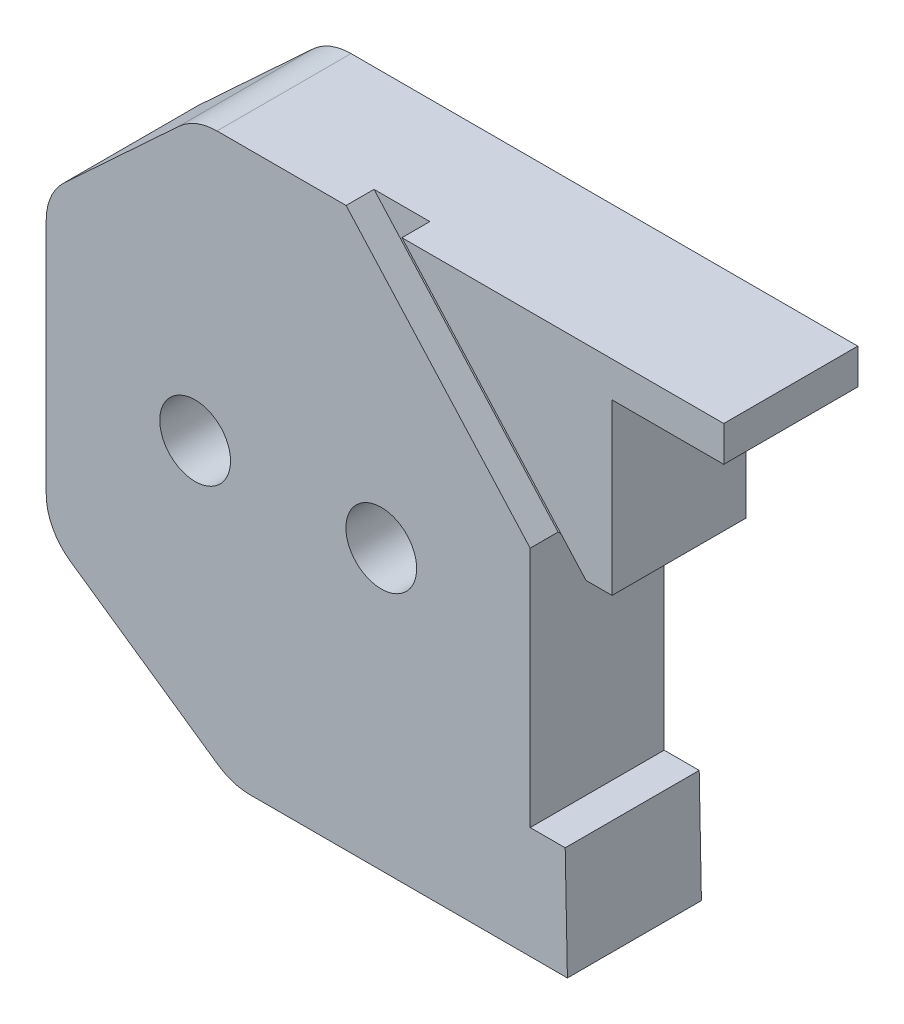
ISO-10303-21;
HEADER;
FILE_DESCRIPTION(('STEP AP214'),'2;1');
FILE_NAME('part.step','',(''),(''),'','','');
FILE_SCHEMA(('AUTOMOTIVE_DESIGN { 1 0 10303 214 1 1 1 1 }'));
ENDSEC;
DATA;
#1=APPLICATION_CONTEXT('core data for automotive mechanical design processes');
#2=APPLICATION_PROTOCOL_DEFINITION('international standard','automotive_design',2000,#1);
#3=PRODUCT_CONTEXT('',#1,'mechanical');
#4=PRODUCT('Part','Part','',(#3));
#5=PRODUCT_RELATED_PRODUCT_CATEGORY('part','',(#4));
#6=PRODUCT_DEFINITION_FORMATION('','',#4);
#7=PRODUCT_DEFINITION_CONTEXT('part definition',#1,'design');
#8=PRODUCT_DEFINITION('design','',#6,#7);
#9=PRODUCT_DEFINITION_SHAPE('','',#8);
#10=(LENGTH_UNIT() NAMED_UNIT(*) SI_UNIT(.MILLI.,.METRE.));
#11=(NAMED_UNIT(*) PLANE_ANGLE_UNIT() SI_UNIT($,.RADIAN.));
#12=(NAMED_UNIT(*) SI_UNIT($,.STERADIAN.) SOLID_ANGLE_UNIT());
#13=UNCERTAINTY_MEASURE_WITH_UNIT(LENGTH_MEASURE(1.E-05),#10,'distance_accuracy_value','');
#14=(GEOMETRIC_REPRESENTATION_CONTEXT(3) GLOBAL_UNCERTAINTY_ASSIGNED_CONTEXT((#13)) GLOBAL_UNIT_ASSIGNED_CONTEXT((#10,
#11,#12)) REPRESENTATION_CONTEXT('',''));
#15=CARTESIAN_POINT('',(0.,0.,0.));
#16=DIRECTION('',(0.,0.,1.));
#17=DIRECTION('',(1.,0.,0.));
#18=AXIS2_PLACEMENT_3D('',#15,#16,#17);
#19=CARTESIAN_POINT('',(0.,0.,6.4));
#20=DIRECTION('',(0.,0.,1.));
#21=DIRECTION('',(1.,0.,0.));
#22=AXIS2_PLACEMENT_3D('',#19,#20,#21);
#23=PLANE('',#22);
#24=CARTESIAN_POINT('',(-11.7,0.,6.4));
#25=DIRECTION('',(0.,0.,1.));
#26=DIRECTION('',(1.,0.,0.));
#27=AXIS2_PLACEMENT_3D('',#24,#25,#26);
#28=CIRCLE('',#27,0.950000000000001);
#29=CARTESIAN_POINT('',(-10.75,0.,6.4));
#30=VERTEX_POINT('',#29);
#31=EDGE_CURVE('E404',#30,#30,#28,.F.);
#32=ORIENTED_EDGE('',*,*,#31,.F.);
#33=EDGE_LOOP('',(#32));
#34=FACE_BOUND('',#33,.T.);
#35=DIRECTION('',(-1.,0.,0.));
#36=VECTOR('',#35,1.);
#37=CARTESIAN_POINT('',(-6.75907917408683,-4.5,6.4));
#38=LINE('',#37,#36);
#39=CARTESIAN_POINT('',(-6.75907917408683,-4.5,6.4));
#40=VERTEX_POINT('',#39);
#41=CARTESIAN_POINT('',(-7.7,-4.5,6.4));
#42=VERTEX_POINT('',#41);
#43=EDGE_CURVE('E435',#40,#42,#38,.T.);
#44=ORIENTED_EDGE('',*,*,#43,.F.);
#45=DIRECTION('',(-0.0196892404925269,0.999806148115137,0.));
#46=VECTOR('',#45,1.);
#47=CARTESIAN_POINT('',(-6.69999999999999,-7.5,6.4));
#48=LINE('',#47,#46);
#49=CARTESIAN_POINT('',(-6.69999999999999,-7.5,6.4));
#50=VERTEX_POINT('',#49);
#51=EDGE_CURVE('E400',#50,#40,#48,.T.);
#52=ORIENTED_EDGE('',*,*,#51,.F.);
#53=DIRECTION('',(1.,0.,0.));
#54=VECTOR('',#53,1.);
#55=CARTESIAN_POINT('',(-15.7,-7.5,6.4));
#56=LINE('',#55,#54);
#57=CARTESIAN_POINT('',(-15.23067743474,-7.5,6.4));
#58=VERTEX_POINT('',#57);
#59=EDGE_CURVE('E423',#58,#50,#56,.T.);
#60=ORIENTED_EDGE('',*,*,#59,.F.);
#61=CARTESIAN_POINT('',(-15.23067743474,-6.,6.4));
#62=DIRECTION('',(0.,0.,1.));
#63=DIRECTION('',(1.,0.,0.));
#64=AXIS2_PLACEMENT_3D('',#61,#62,#63);
#65=CIRCLE('',#64,1.5);
#66=CARTESIAN_POINT('',(-16.0856272804161,-7.23250183017247,6.4));
#67=VERTEX_POINT('',#66);
#68=EDGE_CURVE('E418',#58,#67,#65,.F.);
#69=ORIENTED_EDGE('',*,*,#68,.T.);
#70=DIRECTION('',(0.821667886781642,-0.569966563784045,0.));
#71=VECTOR('',#70,1.);
#72=CARTESIAN_POINT('',(-20.7,-4.03164877833717,6.4));
#73=LINE('',#72,#71);
#74=CARTESIAN_POINT('',(-20.0549498456761,-4.47910087649381,6.4));
#75=VERTEX_POINT('',#74);
#76=EDGE_CURVE('E426',#75,#67,#73,.T.);
#77=ORIENTED_EDGE('',*,*,#76,.F.);
#78=CARTESIAN_POINT('',(-19.2,-3.24659904632135,6.4));
#79=DIRECTION('',(0.,0.,1.));
#80=DIRECTION('',(1.,0.,0.));
#81=AXIS2_PLACEMENT_3D('',#78,#79,#80);
#82=CIRCLE('',#81,1.5);
#83=CARTESIAN_POINT('',(-20.7,-3.24659904632135,6.4));
#84=VERTEX_POINT('',#83);
#85=EDGE_CURVE('E422',#75,#84,#82,.F.);
#86=ORIENTED_EDGE('',*,*,#85,.T.);
#87=DIRECTION('',(0.,-1.,0.));
#88=VECTOR('',#87,1.);
#89=CARTESIAN_POINT('',(-20.7,3.79344266559656,6.4));
#90=LINE('',#89,#88);
#91=CARTESIAN_POINT('',(-20.7,3.13841119589865,6.4));
#92=VERTEX_POINT('',#91);
#93=EDGE_CURVE('E405',#92,#84,#90,.T.);
#94=ORIENTED_EDGE('',*,*,#93,.F.);
#95=CARTESIAN_POINT('',(-19.2,3.13841119589865,6.4));
#96=DIRECTION('',(0.,0.,1.));
#97=DIRECTION('',(1.,0.,0.));
#98=AXIS2_PLACEMENT_3D('',#95,#96,#97);
#99=CIRCLE('',#98,1.5);
#100=CARTESIAN_POINT('',(-20.4444854158793,3.97582151925491,6.4));
#101=VERTEX_POINT('',#100);
#102=EDGE_CURVE('E410',#92,#101,#99,.F.);
#103=ORIENTED_EDGE('',*,*,#102,.T.);
#104=DIRECTION('',(-1.,0.,0.));
#105=VECTOR('',#104,1.);
#106=CARTESIAN_POINT('',(-21.5,3.97582151925491,6.4));
#107=LINE('',#106,#105);
#108=CARTESIAN_POINT('',(-5.5,3.97582151925491,6.4));
#109=VERTEX_POINT('',#108);
#110=EDGE_CURVE('E396',#109,#101,#107,.T.);
#111=ORIENTED_EDGE('',*,*,#110,.F.);
#112=DIRECTION('',(0.,1.,0.));
#113=VECTOR('',#112,1.);
#114=CARTESIAN_POINT('',(-5.5,2.,6.4));
#115=LINE('',#114,#113);
#116=CARTESIAN_POINT('',(-5.5,2.,6.4));
#117=VERTEX_POINT('',#116);
#118=EDGE_CURVE('E417',#117,#109,#115,.T.);
#119=ORIENTED_EDGE('',*,*,#118,.F.);
#120=DIRECTION('',(1.,0.,0.));
#121=VECTOR('',#120,1.);
#122=CARTESIAN_POINT('',(-7.7,2.,6.4));
#123=LINE('',#122,#121);
#124=CARTESIAN_POINT('',(-7.7,2.,6.4));
#125=VERTEX_POINT('',#124);
#126=EDGE_CURVE('E448',#125,#117,#123,.T.);
#127=ORIENTED_EDGE('',*,*,#126,.F.);
#128=DIRECTION('',(0.,1.,0.));
#129=VECTOR('',#128,1.);
#130=CARTESIAN_POINT('',(-7.7,2.,6.4));
#131=LINE('',#130,#129);
#132=EDGE_CURVE('E427',#42,#125,#131,.T.);
#133=ORIENTED_EDGE('',*,*,#132,.F.);
#134=EDGE_LOOP('',(#44,#52,#60,#69,#77,#86,#94,#103,#111,#119,#127,#133));
#135=FACE_BOUND('',#134,.T.);
#136=CARTESIAN_POINT('',(-16.7,0.,6.4));
#137=DIRECTION('',(0.,0.,1.));
#138=DIRECTION('',(1.,0.,0.));
#139=AXIS2_PLACEMENT_3D('',#136,#137,#138);
#140=CIRCLE('',#139,0.950000000000001);
#141=CARTESIAN_POINT('',(-15.75,0.,6.4));
#142=VERTEX_POINT('',#141);
#143=EDGE_CURVE('E43',#142,#142,#140,.F.);
#144=ORIENTED_EDGE('',*,*,#143,.F.);
#145=EDGE_LOOP('',(#144));
#146=FACE_BOUND('',#145,.T.);
#147=ADVANCED_FACE('F40',(#34,#135,#146),#23,.F.);
#148=DIRECTION('',(0.733499750699198,0.679689720184301,0.));
#149=VECTOR('',#148,1.);
#150=CARTESIAN_POINT('',(-20.7,3.79344266559656,6.4));
#151=LINE('',#150,#149);
#152=CARTESIAN_POINT('',(-19.0741707482359,5.3,6.4));
#153=VERTEX_POINT('',#152);
#154=CARTESIAN_POINT('',(-17.131398020196,7.10024962604879,6.4));
#155=VERTEX_POINT('',#154);
#156=EDGE_CURVE('E411',#153,#155,#151,.T.);
#157=ORIENTED_EDGE('',*,*,#156,.T.);
#158=CARTESIAN_POINT('',(-16.1118634399196,6.,6.4));
#159=DIRECTION('',(0.,0.,1.));
#160=DIRECTION('',(1.,0.,0.));
#161=AXIS2_PLACEMENT_3D('',#158,#159,#160);
#162=CIRCLE('',#161,1.5);
#163=CARTESIAN_POINT('',(-16.1118634399196,7.5,6.4));
#164=VERTEX_POINT('',#163);
#165=EDGE_CURVE('E406',#155,#164,#162,.F.);
#166=ORIENTED_EDGE('',*,*,#165,.T.);
#167=DIRECTION('',(-1.,0.,0.));
#168=VECTOR('',#167,1.);
#169=CARTESIAN_POINT('',(-2.5,7.5,6.4));
#170=LINE('',#169,#168);
#171=CARTESIAN_POINT('',(-2.5,7.5,6.4));
#172=VERTEX_POINT('',#171);
#173=EDGE_CURVE('E401',#172,#164,#170,.T.);
#174=ORIENTED_EDGE('',*,*,#173,.F.);
#175=DIRECTION('',(0.,1.,0.));
#176=VECTOR('',#175,1.);
#177=CARTESIAN_POINT('',(-2.5,7.5,6.4));
#178=LINE('',#177,#176);
#179=CARTESIAN_POINT('',(-2.5,6.55,6.4));
#180=VERTEX_POINT('',#179);
#181=EDGE_CURVE('E397',#180,#172,#178,.T.);
#182=ORIENTED_EDGE('',*,*,#181,.F.);
#183=DIRECTION('',(-1.,0.,0.));
#184=VECTOR('',#183,1.);
#185=CARTESIAN_POINT('',(-5.5,6.55,6.4));
#186=LINE('',#185,#184);
#187=CARTESIAN_POINT('',(-5.5,6.55,6.4));
#188=VERTEX_POINT('',#187);
#189=EDGE_CURVE('E49',#180,#188,#186,.T.);
#190=ORIENTED_EDGE('',*,*,#189,.T.);
#191=DIRECTION('',(0.,-1.,0.));
#192=VECTOR('',#191,1.);
#193=CARTESIAN_POINT('',(-5.5,5.3,6.4));
#194=LINE('',#193,#192);
#195=CARTESIAN_POINT('',(-5.5,5.3,6.4));
#196=VERTEX_POINT('',#195);
#197=EDGE_CURVE('E11',#188,#196,#194,.T.);
#198=ORIENTED_EDGE('',*,*,#197,.T.);
#199=DIRECTION('',(1.,0.,0.));
#200=VECTOR('',#199,1.);
#201=CARTESIAN_POINT('',(-5.5,5.3,6.4));
#202=LINE('',#201,#200);
#203=EDGE_CURVE('E57',#153,#196,#202,.T.);
#204=ORIENTED_EDGE('',*,*,#203,.F.);
#205=EDGE_LOOP('',(#157,#166,#174,#182,#190,#198,#204));
#206=FACE_BOUND('',#205,.T.);
#207=ADVANCED_FACE('F464',(#206),#23,.F.);
#208=CARTESIAN_POINT('',(-13.0486671012521,7.94909743070187,10.75));
#209=DIRECTION('',(-0.743637178837734,-0.668583387656511,0.));
#210=DIRECTION('',(0.668583387656511,-0.743637178837734,0.));
#211=AXIS2_PLACEMENT_3D('',#208,#209,#210);
#212=PLANE('',#211);
#213=DIRECTION('',(-0.668583387656511,0.743637178837734,0.));
#214=VECTOR('',#213,1.);
#215=CARTESIAN_POINT('',(-3.2637042254437,-2.93430518195239,10.));
#216=LINE('',#215,#214);
#217=CARTESIAN_POINT('',(-7.7,2.,10.));
#218=VERTEX_POINT('',#217);
#219=CARTESIAN_POINT('',(-12.6448961627471,7.5,10.));
#220=VERTEX_POINT('',#219);
#221=EDGE_CURVE('E392',#218,#220,#216,.T.);
#222=ORIENTED_EDGE('',*,*,#221,.F.);
#223=DIRECTION('',(0.,0.,-1.));
#224=VECTOR('',#223,1.);
#225=CARTESIAN_POINT('',(-7.7,2.,10.));
#226=LINE('',#225,#224);
#227=CARTESIAN_POINT('',(-7.7,2.,9.25));
#228=VERTEX_POINT('',#227);
#229=EDGE_CURVE('E339',#218,#228,#226,.T.);
#230=ORIENTED_EDGE('',*,*,#229,.T.);
#231=DIRECTION('',(0.668583387656511,-0.743637178837734,0.));
#232=VECTOR('',#231,1.);
#233=CARTESIAN_POINT('',(-13.0486671012521,7.94909743070187,9.25));
#234=LINE('',#233,#232);
#235=CARTESIAN_POINT('',(-12.6448961627471,7.5,9.25));
#236=VERTEX_POINT('',#235);
#237=EDGE_CURVE('E246',#236,#228,#234,.T.);
#238=ORIENTED_EDGE('',*,*,#237,.F.);
#239=DIRECTION('',(0.,0.,-1.));
#240=VECTOR('',#239,1.);
#241=CARTESIAN_POINT('',(-12.6448961627471,7.5,2.00000000000001));
#242=LINE('',#241,#240);
#243=EDGE_CURVE('E256',#220,#236,#242,.T.);
#244=ORIENTED_EDGE('',*,*,#243,.F.);
#245=EDGE_LOOP('',(#222,#230,#238,#244));
#246=FACE_BOUND('',#245,.T.);
#247=ADVANCED_FACE('F469',(#246),#212,.F.);
#248=CARTESIAN_POINT('',(-11.5486671012521,7.94909743070187,9.25));
#249=DIRECTION('',(0.,0.,-1.));
#250=DIRECTION('',(-1.,0.,0.));
#251=AXIS2_PLACEMENT_3D('',#248,#249,#250);
#252=PLANE('',#251);
#253=ORIENTED_EDGE('',*,*,#237,.T.);
#254=DIRECTION('',(1.,0.,0.));
#255=VECTOR('',#254,1.);
#256=CARTESIAN_POINT('',(-6.2,2.,9.25));
#257=LINE('',#256,#255);
#258=CARTESIAN_POINT('',(-6.2,2.,9.25));
#259=VERTEX_POINT('',#258);
#260=EDGE_CURVE('E236',#228,#259,#257,.T.);
#261=ORIENTED_EDGE('',*,*,#260,.T.);
#262=DIRECTION('',(0.668583387656511,-0.743637178837734,0.));
#263=VECTOR('',#262,1.);
#264=CARTESIAN_POINT('',(-11.5486671012521,7.94909743070187,9.25));
#265=LINE('',#264,#263);
#266=CARTESIAN_POINT('',(-11.1448961627471,7.5,9.25));
#267=VERTEX_POINT('',#266);
#268=EDGE_CURVE('E247',#267,#259,#265,.T.);
#269=ORIENTED_EDGE('',*,*,#268,.F.);
#270=DIRECTION('',(1.,0.,0.));
#271=VECTOR('',#270,1.);
#272=CARTESIAN_POINT('',(-2.5,7.5,9.25));
#273=LINE('',#272,#271);
#274=EDGE_CURVE('E260',#236,#267,#273,.T.);
#275=ORIENTED_EDGE('',*,*,#274,.F.);
#276=EDGE_LOOP('',(#253,#261,#269,#275));
#277=FACE_BOUND('',#276,.T.);
#278=ADVANCED_FACE('F632',(#277),#252,.F.);
#279=CARTESIAN_POINT('',(-11.5486671012521,7.94909743070187,10.75));
#280=DIRECTION('',(0.743637178837734,0.668583387656511,0.));
#281=DIRECTION('',(-0.668583387656511,0.743637178837734,0.));
#282=AXIS2_PLACEMENT_3D('',#279,#280,#281);
#283=PLANE('',#282);
#284=ORIENTED_EDGE('',*,*,#268,.T.);
#285=DIRECTION('',(0.,0.,1.));
#286=VECTOR('',#285,1.);
#287=CARTESIAN_POINT('',(-6.2,2.,10.75));
#288=LINE('',#287,#286);
#289=CARTESIAN_POINT('',(-6.2,2.,10.));
#290=VERTEX_POINT('',#289);
#291=EDGE_CURVE('E243',#259,#290,#288,.T.);
#292=ORIENTED_EDGE('',*,*,#291,.T.);
#293=DIRECTION('',(0.668583387656511,-0.743637178837734,0.));
#294=VECTOR('',#293,1.);
#295=CARTESIAN_POINT('',(-2.43420984481908,-2.1885299856304,10.));
#296=LINE('',#295,#294);
#297=CARTESIAN_POINT('',(-11.1448961627471,7.5,10.));
#298=VERTEX_POINT('',#297);
#299=EDGE_CURVE('E389',#298,#290,#296,.T.);
#300=ORIENTED_EDGE('',*,*,#299,.F.);
#301=DIRECTION('',(0.,0.,1.));
#302=VECTOR('',#301,1.);
#303=CARTESIAN_POINT('',(-11.1448961627471,7.5,2.));
#304=LINE('',#303,#302);
#305=EDGE_CURVE('E250',#267,#298,#304,.T.);
#306=ORIENTED_EDGE('',*,*,#305,.F.);
#307=EDGE_LOOP('',(#284,#292,#300,#306));
#308=FACE_BOUND('',#307,.T.);
#309=ADVANCED_FACE('F558',(#308),#283,.F.);
#310=CARTESIAN_POINT('',(-2.5,7.5,2.));
#311=DIRECTION('',(0.,-1.,0.));
#312=DIRECTION('',(0.,0.,-1.));
#313=AXIS2_PLACEMENT_3D('',#310,#311,#312);
#314=PLANE('',#313);
#315=DIRECTION('',(0.,0.,-1.));
#316=VECTOR('',#315,1.);
#317=CARTESIAN_POINT('',(-2.5,7.5,10.));
#318=LINE('',#317,#316);
#319=CARTESIAN_POINT('',(-2.5,7.5,10.));
#320=VERTEX_POINT('',#319);
#321=EDGE_CURVE('E331',#320,#172,#318,.T.);
#322=ORIENTED_EDGE('',*,*,#321,.T.);
#323=ORIENTED_EDGE('',*,*,#173,.T.);
#324=DIRECTION('',(0.,0.,-1.));
#325=VECTOR('',#324,1.);
#326=CARTESIAN_POINT('',(-16.1118634399196,7.5,10.));
#327=LINE('',#326,#325);
#328=CARTESIAN_POINT('',(-16.1118634399196,7.5,10.));
#329=VERTEX_POINT('',#328);
#330=EDGE_CURVE('E347',#164,#329,#327,.F.);
#331=ORIENTED_EDGE('',*,*,#330,.T.);
#332=DIRECTION('',(-1.,0.,0.));
#333=VECTOR('',#332,1.);
#334=CARTESIAN_POINT('',(-16.7,7.5,10.));
#335=LINE('',#334,#333);
#336=EDGE_CURVE('E293',#220,#329,#335,.T.);
#337=ORIENTED_EDGE('',*,*,#336,.F.);
#338=ORIENTED_EDGE('',*,*,#243,.T.);
#339=ORIENTED_EDGE('',*,*,#274,.T.);
#340=ORIENTED_EDGE('',*,*,#305,.T.);
#341=EDGE_CURVE('E294',#320,#298,#335,.T.);
#342=ORIENTED_EDGE('',*,*,#341,.F.);
#343=EDGE_LOOP('',(#322,#323,#331,#337,#338,#339,#340,#342));
#344=FACE_BOUND('',#343,.T.);
#345=ADVANCED_FACE('F551',(#344),#314,.F.);
#346=CARTESIAN_POINT('',(-5.5,5.3,10.));
#347=DIRECTION('',(0.,1.,0.));
#348=DIRECTION('',(-1.,0.,0.));
#349=AXIS2_PLACEMENT_3D('',#346,#347,#348);
#350=PLANE('',#349);
#351=DIRECTION('',(0.,0.,-1.));
#352=VECTOR('',#351,1.);
#353=CARTESIAN_POINT('',(-19.0741707482359,5.3,2.));
#354=LINE('',#353,#352);
#355=CARTESIAN_POINT('',(-19.0741707482359,5.3,6.40861202));
#356=VERTEX_POINT('',#355);
#357=EDGE_CURVE('E276',#356,#153,#354,.T.);
#358=ORIENTED_EDGE('',*,*,#357,.T.);
#359=ORIENTED_EDGE('',*,*,#203,.T.);
#360=DIRECTION('',(0.,0.,1.));
#361=VECTOR('',#360,1.);
#362=CARTESIAN_POINT('',(-5.5,5.3,6.4));
#363=LINE('',#362,#361);
#364=CARTESIAN_POINT('',(-5.5,5.3,6.40861202));
#365=VERTEX_POINT('',#364);
#366=EDGE_CURVE('E224',#196,#365,#363,.T.);
#367=ORIENTED_EDGE('',*,*,#366,.T.);
#368=DIRECTION('',(1.,0.,0.));
#369=VECTOR('',#368,1.);
#370=CARTESIAN_POINT('',(-21.5,5.3,6.40861202));
#371=LINE('',#370,#369);
#372=EDGE_CURVE('E272',#356,#365,#371,.T.);
#373=ORIENTED_EDGE('',*,*,#372,.F.);
#374=EDGE_LOOP('',(#358,#359,#367,#373));
#375=FACE_BOUND('',#374,.T.);
#376=ADVANCED_FACE('F549',(#375),#350,.F.);
#377=CARTESIAN_POINT('',(-21.5,3.97582151925491,6.40861202));
#378=DIRECTION('',(0.,0.,1.));
#379=DIRECTION('',(1.,0.,0.));
#380=AXIS2_PLACEMENT_3D('',#377,#378,#379);
#381=PLANE('',#380);
#382=DIRECTION('',(1.,0.,0.));
#383=VECTOR('',#382,1.);
#384=CARTESIAN_POINT('',(-21.5,3.97582151925491,6.40861202));
#385=LINE('',#384,#383);
#386=CARTESIAN_POINT('',(-20.4444854158793,3.97582151925491,6.40861202));
#387=VERTEX_POINT('',#386);
#388=CARTESIAN_POINT('',(-5.5,3.97582151925491,6.40861202));
#389=VERTEX_POINT('',#388);
#390=EDGE_CURVE('E273',#387,#389,#385,.T.);
#391=ORIENTED_EDGE('',*,*,#390,.F.);
#392=CARTESIAN_POINT('',(-19.2,3.13841119589865,6.40861202));
#393=DIRECTION('',(0.,0.,1.));
#394=DIRECTION('',(1.,0.,0.));
#395=AXIS2_PLACEMENT_3D('',#392,#393,#394);
#396=CIRCLE('',#395,1.5);
#397=CARTESIAN_POINT('',(-20.2195345802764,4.23866082194745,6.40861202));
#398=VERTEX_POINT('',#397);
#399=EDGE_CURVE('E386',#387,#398,#396,.F.);
#400=ORIENTED_EDGE('',*,*,#399,.T.);
#401=DIRECTION('',(0.733499750699198,0.679689720184301,0.));
#402=VECTOR('',#401,1.);
#403=CARTESIAN_POINT('',(-20.7,3.79344266559656,6.40861202));
#404=LINE('',#403,#402);
#405=EDGE_CURVE('E282',#398,#356,#404,.T.);
#406=ORIENTED_EDGE('',*,*,#405,.T.);
#407=ORIENTED_EDGE('',*,*,#372,.T.);
#408=DIRECTION('',(0.,-1.,0.));
#409=VECTOR('',#408,1.);
#410=CARTESIAN_POINT('',(-5.5,3.97582151925491,6.40861202));
#411=LINE('',#410,#409);
#412=EDGE_CURVE('E268',#365,#389,#411,.T.);
#413=ORIENTED_EDGE('',*,*,#412,.T.);
#414=EDGE_LOOP('',(#391,#400,#406,#407,#413));
#415=FACE_BOUND('',#414,.T.);
#416=ADVANCED_FACE('F520',(#415),#381,.F.);
#417=CARTESIAN_POINT('',(-21.5,3.97582151925491,6.40861202));
#418=DIRECTION('',(0.,-1.,0.));
#419=DIRECTION('',(0.,0.,-1.));
#420=AXIS2_PLACEMENT_3D('',#417,#418,#419);
#421=PLANE('',#420);
#422=DIRECTION('',(0.,0.,-1.));
#423=VECTOR('',#422,1.);
#424=CARTESIAN_POINT('',(-5.5,3.97582151925491,6.40861202));
#425=LINE('',#424,#423);
#426=EDGE_CURVE('E264',#389,#109,#425,.T.);
#427=ORIENTED_EDGE('',*,*,#426,.T.);
#428=ORIENTED_EDGE('',*,*,#110,.T.);
#429=DIRECTION('',(0.,0.,1.));
#430=VECTOR('',#429,1.);
#431=CARTESIAN_POINT('',(-20.4444854158793,3.97582151925491,2.));
#432=LINE('',#431,#430);
#433=EDGE_CURVE('E383',#101,#387,#432,.T.);
#434=ORIENTED_EDGE('',*,*,#433,.T.);
#435=ORIENTED_EDGE('',*,*,#390,.T.);
#436=EDGE_LOOP('',(#427,#428,#434,#435));
#437=FACE_BOUND('',#436,.T.);
#438=ADVANCED_FACE('F518',(#437),#421,.F.);
#439=CARTESIAN_POINT('',(-7.7,2.,10.));
#440=DIRECTION('',(0.,1.,0.));
#441=DIRECTION('',(0.,0.,1.));
#442=AXIS2_PLACEMENT_3D('',#439,#440,#441);
#443=PLANE('',#442);
#444=EDGE_CURVE('E338',#228,#125,#226,.T.);
#445=ORIENTED_EDGE('',*,*,#444,.T.);
#446=ORIENTED_EDGE('',*,*,#126,.T.);
#447=DIRECTION('',(0.,0.,-1.));
#448=VECTOR('',#447,1.);
#449=CARTESIAN_POINT('',(-5.5,2.,10.));
#450=LINE('',#449,#448);
#451=CARTESIAN_POINT('',(-5.5,2.,10.));
#452=VERTEX_POINT('',#451);
#453=EDGE_CURVE('E335',#452,#117,#450,.T.);
#454=ORIENTED_EDGE('',*,*,#453,.F.);
#455=DIRECTION('',(1.,0.,0.));
#456=VECTOR('',#455,1.);
#457=CARTESIAN_POINT('',(-7.7,2.,10.));
#458=LINE('',#457,#456);
#459=EDGE_CURVE('E207',#290,#452,#458,.T.);
#460=ORIENTED_EDGE('',*,*,#459,.F.);
#461=ORIENTED_EDGE('',*,*,#291,.F.);
#462=ORIENTED_EDGE('',*,*,#260,.F.);
#463=EDGE_LOOP('',(#445,#446,#454,#460,#461,#462));
#464=FACE_BOUND('',#463,.T.);
#465=ADVANCED_FACE('F530',(#464),#443,.F.);
#466=CARTESIAN_POINT('',(-2.5,7.5,10.));
#467=DIRECTION('',(-1.,0.,0.));
#468=DIRECTION('',(0.,0.,1.));
#469=AXIS2_PLACEMENT_3D('',#466,#467,#468);
#470=PLANE('',#469);
#471=DIRECTION('',(0.,0.,1.));
#472=VECTOR('',#471,1.);
#473=CARTESIAN_POINT('',(-2.5,6.55,6.4));
#474=LINE('',#473,#472);
#475=CARTESIAN_POINT('',(-2.5,6.55,10.));
#476=VERTEX_POINT('',#475);
#477=EDGE_CURVE('E219',#180,#476,#474,.T.);
#478=ORIENTED_EDGE('',*,*,#477,.F.);
#479=ORIENTED_EDGE('',*,*,#181,.T.);
#480=ORIENTED_EDGE('',*,*,#321,.F.);
#481=DIRECTION('',(0.,1.,0.));
#482=VECTOR('',#481,1.);
#483=CARTESIAN_POINT('',(-2.5,7.5,10.));
#484=LINE('',#483,#482);
#485=EDGE_CURVE('E212',#476,#320,#484,.T.);
#486=ORIENTED_EDGE('',*,*,#485,.F.);
#487=EDGE_LOOP('',(#478,#479,#480,#486));
#488=FACE_BOUND('',#487,.T.);
#489=ADVANCED_FACE('F562',(#488),#470,.F.);
#490=CARTESIAN_POINT('',(-5.5,2.,10.));
#491=DIRECTION('',(-1.,0.,0.));
#492=DIRECTION('',(0.,-1.,0.));
#493=AXIS2_PLACEMENT_3D('',#490,#491,#492);
#494=PLANE('',#493);
#495=ORIENTED_EDGE('',*,*,#453,.T.);
#496=ORIENTED_EDGE('',*,*,#118,.T.);
#497=ORIENTED_EDGE('',*,*,#426,.F.);
#498=ORIENTED_EDGE('',*,*,#412,.F.);
#499=ORIENTED_EDGE('',*,*,#366,.F.);
#500=ORIENTED_EDGE('',*,*,#197,.F.);
#501=DIRECTION('',(0.,0.,1.));
#502=VECTOR('',#501,1.);
#503=CARTESIAN_POINT('',(-5.5,6.55,6.4));
#504=LINE('',#503,#502);
#505=CARTESIAN_POINT('',(-5.5,6.55,10.));
#506=VERTEX_POINT('',#505);
#507=EDGE_CURVE('E214',#188,#506,#504,.T.);
#508=ORIENTED_EDGE('',*,*,#507,.T.);
#509=DIRECTION('',(0.,1.,0.));
#510=VECTOR('',#509,1.);
#511=CARTESIAN_POINT('',(-5.5,2.,10.));
#512=LINE('',#511,#510);
#513=EDGE_CURVE('E199',#452,#506,#512,.T.);
#514=ORIENTED_EDGE('',*,*,#513,.F.);
#515=EDGE_LOOP('',(#495,#496,#497,#498,#499,#500,#508,#514));
#516=FACE_BOUND('',#515,.T.);
#517=ADVANCED_FACE('F215',(#516),#494,.F.);
#518=CARTESIAN_POINT('',(0.,0.,10.));
#519=DIRECTION('',(0.,0.,-1.));
#520=DIRECTION('',(-1.,0.,0.));
#521=AXIS2_PLACEMENT_3D('',#518,#519,#520);
#522=PLANE('',#521);
#523=ORIENTED_EDGE('',*,*,#513,.T.);
#524=DIRECTION('',(-1.,0.,0.));
#525=VECTOR('',#524,1.);
#526=CARTESIAN_POINT('',(-5.5,6.55,10.));
#527=LINE('',#526,#525);
#528=EDGE_CURVE('E203',#476,#506,#527,.T.);
#529=ORIENTED_EDGE('',*,*,#528,.F.);
#530=ORIENTED_EDGE('',*,*,#485,.T.);
#531=ORIENTED_EDGE('',*,*,#341,.T.);
#532=ORIENTED_EDGE('',*,*,#299,.T.);
#533=ORIENTED_EDGE('',*,*,#459,.T.);
#534=EDGE_LOOP('',(#523,#529,#530,#531,#532,#533));
#535=FACE_BOUND('',#534,.T.);
#536=ADVANCED_FACE('F201',(#535),#522,.F.);
#537=CARTESIAN_POINT('',(-5.5,6.55,6.4));
#538=DIRECTION('',(0.,1.,0.));
#539=DIRECTION('',(-1.,0.,0.));
#540=AXIS2_PLACEMENT_3D('',#537,#538,#539);
#541=PLANE('',#540);
#542=ORIENTED_EDGE('',*,*,#528,.T.);
#543=ORIENTED_EDGE('',*,*,#507,.F.);
#544=ORIENTED_EDGE('',*,*,#189,.F.);
#545=ORIENTED_EDGE('',*,*,#477,.T.);
#546=EDGE_LOOP('',(#542,#543,#544,#545));
#547=FACE_BOUND('',#546,.T.);
#548=ADVANCED_FACE('F221',(#547),#541,.F.);
#549=CARTESIAN_POINT('',(-20.7,3.79344266559656,2.));
#550=DIRECTION('',(-0.679689720184301,0.733499750699198,0.));
#551=DIRECTION('',(-0.733499750699198,-0.679689720184301,0.));
#552=AXIS2_PLACEMENT_3D('',#549,#550,#551);
#553=PLANE('',#552);
#554=ORIENTED_EDGE('',*,*,#156,.F.);
#555=ORIENTED_EDGE('',*,*,#357,.F.);
#556=ORIENTED_EDGE('',*,*,#405,.F.);
#557=DIRECTION('',(0.,0.,-1.));
#558=VECTOR('',#557,1.);
#559=CARTESIAN_POINT('',(-20.2195345802764,4.23866082194745,10.));
#560=LINE('',#559,#558);
#561=CARTESIAN_POINT('',(-20.2195345802764,4.23866082194745,10.));
#562=VERTEX_POINT('',#561);
#563=EDGE_CURVE('E354',#398,#562,#560,.F.);
#564=ORIENTED_EDGE('',*,*,#563,.T.);
#565=DIRECTION('',(-0.733499750699198,-0.679689720184301,0.));
#566=VECTOR('',#565,1.);
#567=CARTESIAN_POINT('',(-16.7,7.5,10.));
#568=LINE('',#567,#566);
#569=CARTESIAN_POINT('',(-17.131398020196,7.10024962604879,10.));
#570=VERTEX_POINT('',#569);
#571=EDGE_CURVE('E298',#570,#562,#568,.T.);
#572=ORIENTED_EDGE('',*,*,#571,.F.);
#573=DIRECTION('',(0.,0.,-1.));
#574=VECTOR('',#573,1.);
#575=CARTESIAN_POINT('',(-17.131398020196,7.10024962604879,0.));
#576=LINE('',#575,#574);
#577=EDGE_CURVE('E350',#570,#155,#576,.T.);
#578=ORIENTED_EDGE('',*,*,#577,.T.);
#579=EDGE_LOOP('',(#554,#555,#556,#564,#572,#578));
#580=FACE_BOUND('',#579,.T.);
#581=ADVANCED_FACE('F547',(#580),#553,.T.);
#582=CARTESIAN_POINT('',(-20.7,3.79344266559656,2.));
#583=DIRECTION('',(1.,0.,0.));
#584=DIRECTION('',(0.,1.,0.));
#585=AXIS2_PLACEMENT_3D('',#582,#583,#584);
#586=PLANE('',#585);
#587=DIRECTION('',(0.,0.,-1.));
#588=VECTOR('',#587,1.);
#589=CARTESIAN_POINT('',(-20.7,3.13841119589865,0.));
#590=LINE('',#589,#588);
#591=CARTESIAN_POINT('',(-20.7,3.13841119589865,10.));
#592=VERTEX_POINT('',#591);
#593=EDGE_CURVE('E364',#592,#92,#590,.T.);
#594=ORIENTED_EDGE('',*,*,#593,.T.);
#595=ORIENTED_EDGE('',*,*,#93,.T.);
#596=DIRECTION('',(0.,0.,-1.));
#597=VECTOR('',#596,1.);
#598=CARTESIAN_POINT('',(-20.7,-3.24659904632135,2.));
#599=LINE('',#598,#597);
#600=CARTESIAN_POINT('',(-20.7,-3.24659904632135,10.));
#601=VERTEX_POINT('',#600);
#602=EDGE_CURVE('E368',#84,#601,#599,.F.);
#603=ORIENTED_EDGE('',*,*,#602,.T.);
#604=DIRECTION('',(0.,-1.,0.));
#605=VECTOR('',#604,1.);
#606=CARTESIAN_POINT('',(-20.7,-4.03164877833717,10.));
#607=LINE('',#606,#605);
#608=EDGE_CURVE('E302',#592,#601,#607,.T.);
#609=ORIENTED_EDGE('',*,*,#608,.F.);
#610=EDGE_LOOP('',(#594,#595,#603,#609));
#611=FACE_BOUND('',#610,.T.);
#612=ADVANCED_FACE('F510',(#611),#586,.F.);
#613=CARTESIAN_POINT('',(-20.7,-4.03164877833717,2.));
#614=DIRECTION('',(0.569966563784045,0.821667886781642,0.));
#615=DIRECTION('',(-0.821667886781642,0.569966563784045,0.));
#616=AXIS2_PLACEMENT_3D('',#613,#614,#615);
#617=PLANE('',#616);
#618=DIRECTION('',(0.,0.,-1.));
#619=VECTOR('',#618,1.);
#620=CARTESIAN_POINT('',(-20.0549498456761,-4.47910087649381,2.));
#621=LINE('',#620,#619);
#622=CARTESIAN_POINT('',(-20.0549498456761,-4.47910087649381,10.));
#623=VERTEX_POINT('',#622);
#624=EDGE_CURVE('E357',#623,#75,#621,.T.);
#625=ORIENTED_EDGE('',*,*,#624,.T.);
#626=ORIENTED_EDGE('',*,*,#76,.T.);
#627=DIRECTION('',(0.,0.,-1.));
#628=VECTOR('',#627,1.);
#629=CARTESIAN_POINT('',(-16.0856272804161,-7.23250183017247,2.));
#630=LINE('',#629,#628);
#631=CARTESIAN_POINT('',(-16.0856272804161,-7.23250183017247,10.));
#632=VERTEX_POINT('',#631);
#633=EDGE_CURVE('E361',#67,#632,#630,.F.);
#634=ORIENTED_EDGE('',*,*,#633,.T.);
#635=DIRECTION('',(0.821667886781642,-0.569966563784045,0.));
#636=VECTOR('',#635,1.);
#637=CARTESIAN_POINT('',(-20.7,-4.03164877833717,10.));
#638=LINE('',#637,#636);
#639=EDGE_CURVE('E306',#623,#632,#638,.T.);
#640=ORIENTED_EDGE('',*,*,#639,.F.);
#641=EDGE_LOOP('',(#625,#626,#634,#640));
#642=FACE_BOUND('',#641,.T.);
#643=ADVANCED_FACE('F496',(#642),#617,.F.);
#644=CARTESIAN_POINT('',(-11.7,0.,10.));
#645=DIRECTION('',(0.,0.,1.));
#646=DIRECTION('',(1.,0.,0.));
#647=AXIS2_PLACEMENT_3D('',#644,#645,#646);
#648=CIRCLE('',#647,0.950000000000001);
#649=CARTESIAN_POINT('',(-10.75,0.,10.));
#650=VERTEX_POINT('',#649);
#651=EDGE_CURVE('E232',#650,#650,#648,.T.);
#652=ORIENTED_EDGE('',*,*,#651,.F.);
#653=EDGE_LOOP('',(#652));
#654=FACE_BOUND('',#653,.T.);
#655=CARTESIAN_POINT('',(-16.7,0.,10.));
#656=DIRECTION('',(0.,0.,1.));
#657=DIRECTION('',(1.,0.,0.));
#658=AXIS2_PLACEMENT_3D('',#655,#656,#657);
#659=CIRCLE('',#658,0.950000000000001);
#660=CARTESIAN_POINT('',(-15.75,0.,10.));
#661=VERTEX_POINT('',#660);
#662=EDGE_CURVE('E218',#661,#661,#659,.T.);
#663=ORIENTED_EDGE('',*,*,#662,.F.);
#664=EDGE_LOOP('',(#663));
#665=FACE_BOUND('',#664,.T.);
#666=DIRECTION('',(0.,1.,0.));
#667=VECTOR('',#666,1.);
#668=CARTESIAN_POINT('',(-7.7,2.,10.));
#669=LINE('',#668,#667);
#670=CARTESIAN_POINT('',(-7.7,-4.5,10.));
#671=VERTEX_POINT('',#670);
#672=EDGE_CURVE('E285',#671,#218,#669,.T.);
#673=ORIENTED_EDGE('',*,*,#672,.T.);
#674=ORIENTED_EDGE('',*,*,#221,.T.);
#675=ORIENTED_EDGE('',*,*,#336,.T.);
#676=CARTESIAN_POINT('',(-16.1118634399196,6.,10.));
#677=DIRECTION('',(0.,0.,-1.));
#678=DIRECTION('',(-1.,0.,0.));
#679=AXIS2_PLACEMENT_3D('',#676,#677,#678);
#680=CIRCLE('',#679,1.5);
#681=EDGE_CURVE('E371',#329,#570,#680,.F.);
#682=ORIENTED_EDGE('',*,*,#681,.T.);
#683=ORIENTED_EDGE('',*,*,#571,.T.);
#684=CARTESIAN_POINT('',(-19.2,3.13841119589865,10.));
#685=DIRECTION('',(0.,0.,-1.));
#686=DIRECTION('',(-1.,0.,0.));
#687=AXIS2_PLACEMENT_3D('',#684,#685,#686);
#688=CIRCLE('',#687,1.5);
#689=EDGE_CURVE('E374',#562,#592,#688,.F.);
#690=ORIENTED_EDGE('',*,*,#689,.T.);
#691=ORIENTED_EDGE('',*,*,#608,.T.);
#692=CARTESIAN_POINT('',(-19.2,-3.24659904632135,10.));
#693=DIRECTION('',(0.,0.,-1.));
#694=DIRECTION('',(-1.,0.,0.));
#695=AXIS2_PLACEMENT_3D('',#692,#693,#694);
#696=CIRCLE('',#695,1.5);
#697=EDGE_CURVE('E377',#601,#623,#696,.F.);
#698=ORIENTED_EDGE('',*,*,#697,.T.);
#699=ORIENTED_EDGE('',*,*,#639,.T.);
#700=CARTESIAN_POINT('',(-15.23067743474,-6.,10.));
#701=DIRECTION('',(0.,0.,-1.));
#702=DIRECTION('',(-1.,0.,0.));
#703=AXIS2_PLACEMENT_3D('',#700,#701,#702);
#704=CIRCLE('',#703,1.5);
#705=CARTESIAN_POINT('',(-15.23067743474,-7.5,10.));
#706=VERTEX_POINT('',#705);
#707=EDGE_CURVE('E380',#632,#706,#704,.F.);
#708=ORIENTED_EDGE('',*,*,#707,.T.);
#709=DIRECTION('',(1.,0.,0.));
#710=VECTOR('',#709,1.);
#711=CARTESIAN_POINT('',(-15.7,-7.5,10.));
#712=LINE('',#711,#710);
#713=CARTESIAN_POINT('',(-6.69999999999999,-7.5,10.));
#714=VERTEX_POINT('',#713);
#715=EDGE_CURVE('E310',#706,#714,#712,.T.);
#716=ORIENTED_EDGE('',*,*,#715,.T.);
#717=DIRECTION('',(-0.0196892404925269,0.999806148115137,0.));
#718=VECTOR('',#717,1.);
#719=CARTESIAN_POINT('',(-6.69999999999999,-7.5,10.));
#720=LINE('',#719,#718);
#721=CARTESIAN_POINT('',(-6.75907917408683,-4.5,10.));
#722=VERTEX_POINT('',#721);
#723=EDGE_CURVE('E313',#714,#722,#720,.T.);
#724=ORIENTED_EDGE('',*,*,#723,.T.);
#725=DIRECTION('',(-1.,0.,0.));
#726=VECTOR('',#725,1.);
#727=CARTESIAN_POINT('',(-6.75907917408683,-4.5,10.));
#728=LINE('',#727,#726);
#729=EDGE_CURVE('E316',#722,#671,#728,.T.);
#730=ORIENTED_EDGE('',*,*,#729,.T.);
#731=EDGE_LOOP('',(#673,#674,#675,#682,#683,#690,#691,#698,#699,#708,#716,#724,#730));
#732=FACE_BOUND('',#731,.T.);
#733=ADVANCED_FACE('F499',(#654,#665,#732),#522,.F.);
#734=CARTESIAN_POINT('',(-15.7,-7.5,2.));
#735=DIRECTION('',(0.,1.,0.));
#736=DIRECTION('',(-1.,0.,0.));
#737=AXIS2_PLACEMENT_3D('',#734,#735,#736);
#738=PLANE('',#737);
#739=DIRECTION('',(0.,0.,-1.));
#740=VECTOR('',#739,1.);
#741=CARTESIAN_POINT('',(-15.23067743474,-7.5,2.));
#742=LINE('',#741,#740);
#743=EDGE_CURVE('E343',#706,#58,#742,.T.);
#744=ORIENTED_EDGE('',*,*,#743,.T.);
#745=ORIENTED_EDGE('',*,*,#59,.T.);
#746=DIRECTION('',(0.,0.,-1.));
#747=VECTOR('',#746,1.);
#748=CARTESIAN_POINT('',(-6.69999999999999,-7.5,10.));
#749=LINE('',#748,#747);
#750=EDGE_CURVE('E327',#714,#50,#749,.T.);
#751=ORIENTED_EDGE('',*,*,#750,.F.);
#752=ORIENTED_EDGE('',*,*,#715,.F.);
#753=EDGE_LOOP('',(#744,#745,#751,#752));
#754=FACE_BOUND('',#753,.T.);
#755=ADVANCED_FACE('F487',(#754),#738,.F.);
#756=CARTESIAN_POINT('',(-15.23067743474,-6.,2.));
#757=DIRECTION('',(0.,0.,-1.));
#758=DIRECTION('',(-1.,0.,0.));
#759=AXIS2_PLACEMENT_3D('',#756,#757,#758);
#760=CYLINDRICAL_SURFACE('',#759,1.5);
#761=ORIENTED_EDGE('',*,*,#68,.F.);
#762=ORIENTED_EDGE('',*,*,#743,.F.);
#763=ORIENTED_EDGE('',*,*,#707,.F.);
#764=ORIENTED_EDGE('',*,*,#633,.F.);
#765=EDGE_LOOP('',(#761,#762,#763,#764));
#766=FACE_BOUND('',#765,.T.);
#767=ADVANCED_FACE('F493',(#766),#760,.T.);
#768=CARTESIAN_POINT('',(-19.2,-3.24659904632135,2.));
#769=DIRECTION('',(0.,0.,-1.));
#770=DIRECTION('',(-1.,0.,0.));
#771=AXIS2_PLACEMENT_3D('',#768,#769,#770);
#772=CYLINDRICAL_SURFACE('',#771,1.5);
#773=ORIENTED_EDGE('',*,*,#85,.F.);
#774=ORIENTED_EDGE('',*,*,#624,.F.);
#775=ORIENTED_EDGE('',*,*,#697,.F.);
#776=ORIENTED_EDGE('',*,*,#602,.F.);
#777=EDGE_LOOP('',(#773,#774,#775,#776));
#778=FACE_BOUND('',#777,.T.);
#779=ADVANCED_FACE('F504',(#778),#772,.T.);
#780=CARTESIAN_POINT('',(-19.2,3.13841119589865,2.));
#781=DIRECTION('',(0.,0.,1.));
#782=DIRECTION('',(1.,0.,0.));
#783=AXIS2_PLACEMENT_3D('',#780,#781,#782);
#784=CYLINDRICAL_SURFACE('',#783,1.5);
#785=ORIENTED_EDGE('',*,*,#102,.F.);
#786=ORIENTED_EDGE('',*,*,#593,.F.);
#787=ORIENTED_EDGE('',*,*,#689,.F.);
#788=ORIENTED_EDGE('',*,*,#563,.F.);
#789=ORIENTED_EDGE('',*,*,#399,.F.);
#790=ORIENTED_EDGE('',*,*,#433,.F.);
#791=EDGE_LOOP('',(#785,#786,#787,#788,#789,#790));
#792=FACE_BOUND('',#791,.T.);
#793=ADVANCED_FACE('F513',(#792),#784,.T.);
#794=CARTESIAN_POINT('',(-16.1118634399196,6.,2.));
#795=DIRECTION('',(0.,0.,1.));
#796=DIRECTION('',(1.,0.,0.));
#797=AXIS2_PLACEMENT_3D('',#794,#795,#796);
#798=CYLINDRICAL_SURFACE('',#797,1.5);
#799=ORIENTED_EDGE('',*,*,#165,.F.);
#800=ORIENTED_EDGE('',*,*,#577,.F.);
#801=ORIENTED_EDGE('',*,*,#681,.F.);
#802=ORIENTED_EDGE('',*,*,#330,.F.);
#803=EDGE_LOOP('',(#799,#800,#801,#802));
#804=FACE_BOUND('',#803,.T.);
#805=ADVANCED_FACE('F544',(#804),#798,.T.);
#806=CARTESIAN_POINT('',(-7.7,2.,10.));
#807=DIRECTION('',(-1.,0.,0.));
#808=DIRECTION('',(0.,0.,1.));
#809=AXIS2_PLACEMENT_3D('',#806,#807,#808);
#810=PLANE('',#809);
#811=DIRECTION('',(0.,0.,-1.));
#812=VECTOR('',#811,1.);
#813=CARTESIAN_POINT('',(-7.7,-4.5,10.));
#814=LINE('',#813,#812);
#815=EDGE_CURVE('E319',#671,#42,#814,.T.);
#816=ORIENTED_EDGE('',*,*,#815,.T.);
#817=ORIENTED_EDGE('',*,*,#132,.T.);
#818=ORIENTED_EDGE('',*,*,#444,.F.);
#819=ORIENTED_EDGE('',*,*,#229,.F.);
#820=ORIENTED_EDGE('',*,*,#672,.F.);
#821=EDGE_LOOP('',(#816,#817,#818,#819,#820));
#822=FACE_BOUND('',#821,.T.);
#823=ADVANCED_FACE('F568',(#822),#810,.F.);
#824=CARTESIAN_POINT('',(-6.69999999999999,-7.5,10.));
#825=DIRECTION('',(-0.999806148115137,-0.0196892404925269,0.));
#826=DIRECTION('',(0.0196892404925269,-0.999806148115137,0.));
#827=AXIS2_PLACEMENT_3D('',#824,#825,#826);
#828=PLANE('',#827);
#829=ORIENTED_EDGE('',*,*,#750,.T.);
#830=ORIENTED_EDGE('',*,*,#51,.T.);
#831=DIRECTION('',(0.,0.,-1.));
#832=VECTOR('',#831,1.);
#833=CARTESIAN_POINT('',(-6.75907917408683,-4.5,10.));
#834=LINE('',#833,#832);
#835=EDGE_CURVE('E323',#722,#40,#834,.T.);
#836=ORIENTED_EDGE('',*,*,#835,.F.);
#837=ORIENTED_EDGE('',*,*,#723,.F.);
#838=EDGE_LOOP('',(#829,#830,#836,#837));
#839=FACE_BOUND('',#838,.T.);
#840=ADVANCED_FACE('F483',(#839),#828,.F.);
#841=CARTESIAN_POINT('',(-6.75907917408683,-4.5,10.));
#842=DIRECTION('',(0.,-1.,0.));
#843=DIRECTION('',(0.,0.,-1.));
#844=AXIS2_PLACEMENT_3D('',#841,#842,#843);
#845=PLANE('',#844);
#846=ORIENTED_EDGE('',*,*,#835,.T.);
#847=ORIENTED_EDGE('',*,*,#43,.T.);
#848=ORIENTED_EDGE('',*,*,#815,.F.);
#849=ORIENTED_EDGE('',*,*,#729,.F.);
#850=EDGE_LOOP('',(#846,#847,#848,#849));
#851=FACE_BOUND('',#850,.T.);
#852=ADVANCED_FACE('F480',(#851),#845,.F.);
#853=CARTESIAN_POINT('',(-11.7,0.,2.));
#854=DIRECTION('',(0.,0.,1.));
#855=DIRECTION('',(1.,0.,0.));
#856=AXIS2_PLACEMENT_3D('',#853,#854,#855);
#857=CYLINDRICAL_SURFACE('',#856,0.950000000000001);
#858=ORIENTED_EDGE('',*,*,#31,.T.);
#859=EDGE_LOOP('',(#858));
#860=FACE_BOUND('',#859,.T.);
#861=ORIENTED_EDGE('',*,*,#651,.T.);
#862=EDGE_LOOP('',(#861));
#863=FACE_BOUND('',#862,.T.);
#864=ADVANCED_FACE('F604',(#860,#863),#857,.F.);
#865=CARTESIAN_POINT('',(-16.7,0.,2.));
#866=DIRECTION('',(0.,0.,1.));
#867=DIRECTION('',(1.,0.,0.));
#868=AXIS2_PLACEMENT_3D('',#865,#866,#867);
#869=CYLINDRICAL_SURFACE('',#868,0.950000000000001);
#870=ORIENTED_EDGE('',*,*,#143,.T.);
#871=EDGE_LOOP('',(#870));
#872=FACE_BOUND('',#871,.T.);
#873=ORIENTED_EDGE('',*,*,#662,.T.);
#874=EDGE_LOOP('',(#873));
#875=FACE_BOUND('',#874,.T.);
#876=ADVANCED_FACE('F460',(#872,#875),#869,.F.);
#877=CLOSED_SHELL('',(#147,#207,#247,#278,#309,#345,#376,#416,#438,#465,#489,#517,#536,#548,
#581,#612,#643,#733,#755,#767,#779,#793,#805,#823,#840,#852,#864,#876));
#878=MANIFOLD_SOLID_BREP('B2',#877);
#879=ADVANCED_BREP_SHAPE_REPRESENTATION('',(#18,#878),#14);
#880=SHAPE_DEFINITION_REPRESENTATION(#9,#879);
ENDSEC;
END-ISO-10303-21;
